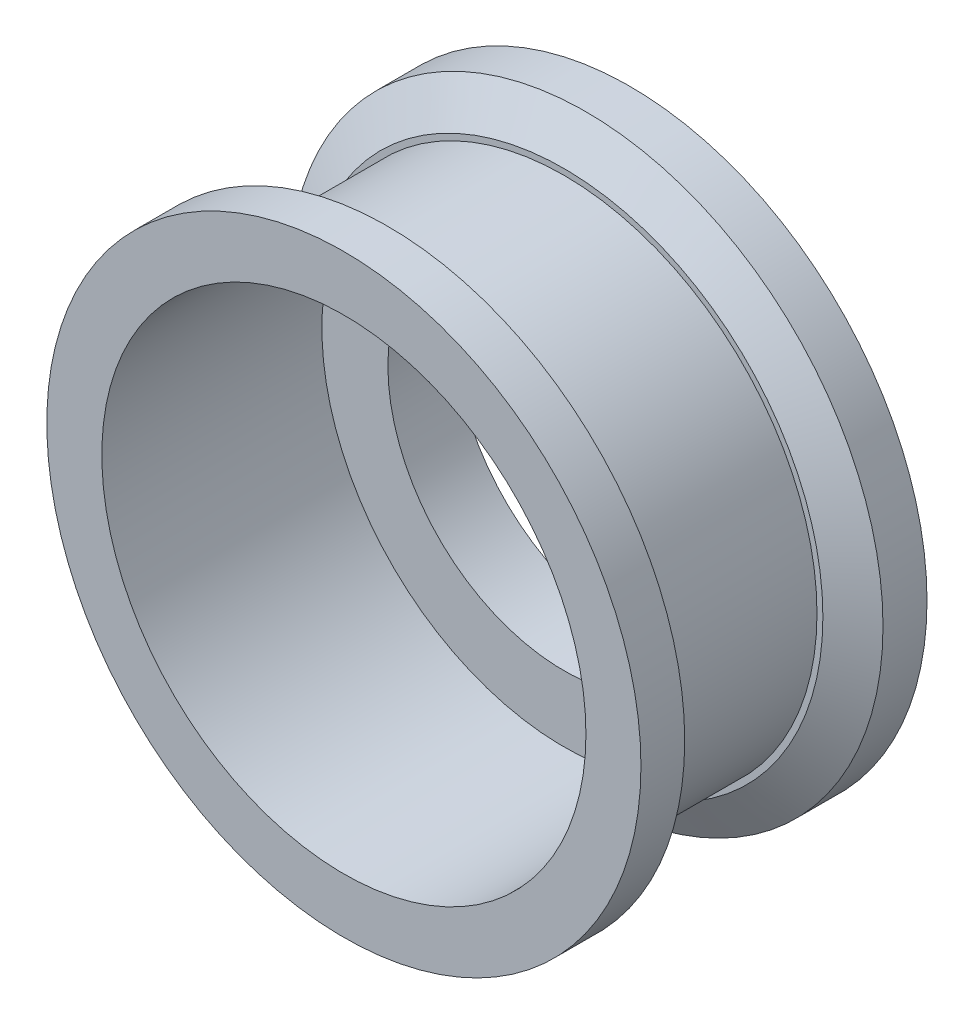
ISO-10303-21;
HEADER;
FILE_DESCRIPTION(('STEP AP214'),'2;1');
FILE_NAME('part.step','',(''),(''),'','','');
FILE_SCHEMA(('AUTOMOTIVE_DESIGN { 1 0 10303 214 1 1 1 1 }'));
ENDSEC;
DATA;
#1=APPLICATION_CONTEXT('core data for automotive mechanical design processes');
#2=APPLICATION_PROTOCOL_DEFINITION('international standard','automotive_design',2000,#1);
#3=PRODUCT_CONTEXT('',#1,'mechanical');
#4=PRODUCT('Part','Part','',(#3));
#5=PRODUCT_RELATED_PRODUCT_CATEGORY('part','',(#4));
#6=PRODUCT_DEFINITION_FORMATION('','',#4);
#7=PRODUCT_DEFINITION_CONTEXT('part definition',#1,'design');
#8=PRODUCT_DEFINITION('design','',#6,#7);
#9=PRODUCT_DEFINITION_SHAPE('','',#8);
#10=(LENGTH_UNIT() NAMED_UNIT(*) SI_UNIT(.MILLI.,.METRE.));
#11=(NAMED_UNIT(*) PLANE_ANGLE_UNIT() SI_UNIT($,.RADIAN.));
#12=(NAMED_UNIT(*) SI_UNIT($,.STERADIAN.) SOLID_ANGLE_UNIT());
#13=UNCERTAINTY_MEASURE_WITH_UNIT(LENGTH_MEASURE(1.E-05),#10,'distance_accuracy_value','');
#14=(GEOMETRIC_REPRESENTATION_CONTEXT(3) GLOBAL_UNCERTAINTY_ASSIGNED_CONTEXT((#13)) GLOBAL_UNIT_ASSIGNED_CONTEXT((#10,
#11,#12)) REPRESENTATION_CONTEXT('',''));
#15=CARTESIAN_POINT('',(0.,0.,0.));
#16=DIRECTION('',(0.,0.,1.));
#17=DIRECTION('',(1.,0.,0.));
#18=AXIS2_PLACEMENT_3D('',#15,#16,#17);
#19=CARTESIAN_POINT('',(0.,0.,13.));
#20=DIRECTION('',(0.,0.,-1.));
#21=DIRECTION('',(-1.,0.,0.));
#22=AXIS2_PLACEMENT_3D('',#19,#20,#21);
#23=CYLINDRICAL_SURFACE('',#22,13.5);
#24=CARTESIAN_POINT('',(0.,0.,2.00000000000001));
#25=DIRECTION('',(0.,0.,1.));
#26=DIRECTION('',(1.,0.,0.));
#27=AXIS2_PLACEMENT_3D('',#24,#25,#26);
#28=CIRCLE('',#27,13.5);
#29=CARTESIAN_POINT('',(13.5,0.,2.00000000000001));
#30=VERTEX_POINT('',#29);
#31=EDGE_CURVE('E11',#30,#30,#28,.F.);
#32=ORIENTED_EDGE('',*,*,#31,.T.);
#33=EDGE_LOOP('',(#32));
#34=FACE_BOUND('',#33,.T.);
#35=CARTESIAN_POINT('',(0.,0.,0.));
#36=DIRECTION('',(0.,0.,1.));
#37=DIRECTION('',(1.,0.,0.));
#38=AXIS2_PLACEMENT_3D('',#35,#36,#37);
#39=CIRCLE('',#38,13.5);
#40=CARTESIAN_POINT('',(13.5,0.,0.));
#41=VERTEX_POINT('',#40);
#42=EDGE_CURVE('E69',#41,#41,#39,.T.);
#43=ORIENTED_EDGE('',*,*,#42,.T.);
#44=EDGE_LOOP('',(#43));
#45=FACE_BOUND('',#44,.T.);
#46=ADVANCED_FACE('F38',(#34,#45),#23,.T.);
#47=CARTESIAN_POINT('',(0.,0.,13.));
#48=DIRECTION('',(0.,0.,-1.));
#49=DIRECTION('',(-1.,0.,0.));
#50=AXIS2_PLACEMENT_3D('',#47,#48,#49);
#51=CYLINDRICAL_SURFACE('',#50,8.);
#52=CARTESIAN_POINT('',(0.,0.,0.));
#53=DIRECTION('',(0.,0.,1.));
#54=DIRECTION('',(1.,0.,0.));
#55=AXIS2_PLACEMENT_3D('',#52,#53,#54);
#56=CIRCLE('',#55,8.);
#57=CARTESIAN_POINT('',(8.,0.,0.));
#58=VERTEX_POINT('',#57);
#59=EDGE_CURVE('E67',#58,#58,#56,.T.);
#60=ORIENTED_EDGE('',*,*,#59,.F.);
#61=EDGE_LOOP('',(#60));
#62=FACE_BOUND('',#61,.T.);
#63=CARTESIAN_POINT('',(0.,0.,3.));
#64=DIRECTION('',(0.,0.,1.));
#65=DIRECTION('',(1.,0.,0.));
#66=AXIS2_PLACEMENT_3D('',#63,#64,#65);
#67=CIRCLE('',#66,8.);
#68=CARTESIAN_POINT('',(8.,0.,3.));
#69=VERTEX_POINT('',#68);
#70=EDGE_CURVE('E63',#69,#69,#67,.T.);
#71=ORIENTED_EDGE('',*,*,#70,.T.);
#72=EDGE_LOOP('',(#71));
#73=FACE_BOUND('',#72,.T.);
#74=ADVANCED_FACE('F114',(#62,#73),#51,.F.);
#75=CARTESIAN_POINT('',(0.,0.,13.));
#76=DIRECTION('',(0.,0.,1.));
#77=DIRECTION('',(1.,0.,0.));
#78=AXIS2_PLACEMENT_3D('',#75,#76,#77);
#79=PLANE('',#78);
#80=CARTESIAN_POINT('',(0.,0.,13.));
#81=DIRECTION('',(0.,0.,1.));
#82=DIRECTION('',(1.,0.,0.));
#83=AXIS2_PLACEMENT_3D('',#80,#81,#82);
#84=CIRCLE('',#83,11.);
#85=CARTESIAN_POINT('',(11.,0.,13.));
#86=VERTEX_POINT('',#85);
#87=EDGE_CURVE('E79',#86,#86,#84,.T.);
#88=ORIENTED_EDGE('',*,*,#87,.F.);
#89=EDGE_LOOP('',(#88));
#90=FACE_BOUND('',#89,.T.);
#91=CARTESIAN_POINT('',(0.,0.,13.));
#92=DIRECTION('',(0.,0.,1.));
#93=DIRECTION('',(1.,0.,0.));
#94=AXIS2_PLACEMENT_3D('',#91,#92,#93);
#95=CIRCLE('',#94,13.5);
#96=CARTESIAN_POINT('',(13.5,0.,13.));
#97=VERTEX_POINT('',#96);
#98=EDGE_CURVE('E62',#97,#97,#95,.T.);
#99=ORIENTED_EDGE('',*,*,#98,.T.);
#100=EDGE_LOOP('',(#99));
#101=FACE_BOUND('',#100,.T.);
#102=ADVANCED_FACE('F120',(#90,#101),#79,.T.);
#103=CARTESIAN_POINT('',(0.,0.,0.));
#104=DIRECTION('',(0.,0.,1.));
#105=DIRECTION('',(1.,0.,0.));
#106=AXIS2_PLACEMENT_3D('',#103,#104,#105);
#107=PLANE('',#106);
#108=ORIENTED_EDGE('',*,*,#42,.F.);
#109=EDGE_LOOP('',(#108));
#110=FACE_BOUND('',#109,.T.);
#111=ORIENTED_EDGE('',*,*,#59,.T.);
#112=EDGE_LOOP('',(#111));
#113=FACE_BOUND('',#112,.T.);
#114=ADVANCED_FACE('F126',(#110,#113),#107,.F.);
#115=CARTESIAN_POINT('',(0.,0.,11.0103629710818));
#116=DIRECTION('',(0.,0.,1.));
#117=DIRECTION('',(1.,0.,0.));
#118=AXIS2_PLACEMENT_3D('',#115,#116,#117);
#119=CIRCLE('',#118,13.5);
#120=CARTESIAN_POINT('',(13.5,0.,11.0103629710818));
#121=VERTEX_POINT('',#120);
#122=EDGE_CURVE('E56',#121,#121,#119,.T.);
#123=ORIENTED_EDGE('',*,*,#122,.T.);
#124=EDGE_LOOP('',(#123));
#125=FACE_BOUND('',#124,.T.);
#126=ORIENTED_EDGE('',*,*,#98,.F.);
#127=EDGE_LOOP('',(#126));
#128=FACE_BOUND('',#127,.T.);
#129=ADVANCED_FACE('F116',(#125,#128),#23,.T.);
#130=CARTESIAN_POINT('',(0.,0.,3.));
#131=DIRECTION('',(0.,0.,1.));
#132=DIRECTION('',(1.,0.,0.));
#133=AXIS2_PLACEMENT_3D('',#130,#131,#132);
#134=CYLINDRICAL_SURFACE('',#133,11.);
#135=CARTESIAN_POINT('',(0.,0.,3.));
#136=DIRECTION('',(0.,0.,1.));
#137=DIRECTION('',(1.,0.,0.));
#138=AXIS2_PLACEMENT_3D('',#135,#136,#137);
#139=CIRCLE('',#138,11.);
#140=CARTESIAN_POINT('',(11.,0.,3.));
#141=VERTEX_POINT('',#140);
#142=EDGE_CURVE('E68',#141,#141,#139,.T.);
#143=ORIENTED_EDGE('',*,*,#142,.F.);
#144=EDGE_LOOP('',(#143));
#145=FACE_BOUND('',#144,.T.);
#146=ORIENTED_EDGE('',*,*,#87,.T.);
#147=EDGE_LOOP('',(#146));
#148=FACE_BOUND('',#147,.T.);
#149=ADVANCED_FACE('F109',(#145,#148),#134,.F.);
#150=CARTESIAN_POINT('',(0.,0.,3.));
#151=DIRECTION('',(0.,0.,1.));
#152=DIRECTION('',(1.,0.,0.));
#153=AXIS2_PLACEMENT_3D('',#150,#151,#152);
#154=PLANE('',#153);
#155=ORIENTED_EDGE('',*,*,#70,.F.);
#156=EDGE_LOOP('',(#155));
#157=FACE_BOUND('',#156,.T.);
#158=ORIENTED_EDGE('',*,*,#142,.T.);
#159=EDGE_LOOP('',(#158));
#160=FACE_BOUND('',#159,.T.);
#161=ADVANCED_FACE('F101',(#157,#160),#154,.T.);
#162=CARTESIAN_POINT('',(0.,0.,3.));
#163=DIRECTION('',(0.,0.,1.));
#164=DIRECTION('',(1.,0.,0.));
#165=AXIS2_PLACEMENT_3D('',#162,#163,#164);
#166=PLANE('',#165);
#167=CARTESIAN_POINT('',(0.,0.,3.));
#168=DIRECTION('',(0.,0.,1.));
#169=DIRECTION('',(1.,0.,0.));
#170=AXIS2_PLACEMENT_3D('',#167,#168,#169);
#171=CIRCLE('',#170,11.7679491924311);
#172=CARTESIAN_POINT('',(11.7679491924311,0.,3.));
#173=VERTEX_POINT('',#172);
#174=EDGE_CURVE('E46',#173,#173,#171,.T.);
#175=ORIENTED_EDGE('',*,*,#174,.T.);
#176=EDGE_LOOP('',(#175));
#177=FACE_BOUND('',#176,.T.);
#178=CARTESIAN_POINT('',(0.,0.,3.));
#179=DIRECTION('',(0.,0.,1.));
#180=DIRECTION('',(1.,0.,0.));
#181=AXIS2_PLACEMENT_3D('',#178,#179,#180);
#182=CIRCLE('',#181,11.5);
#183=CARTESIAN_POINT('',(11.5,0.,3.));
#184=VERTEX_POINT('',#183);
#185=EDGE_CURVE('E83',#184,#184,#182,.T.);
#186=ORIENTED_EDGE('',*,*,#185,.F.);
#187=EDGE_LOOP('',(#186));
#188=FACE_BOUND('',#187,.T.);
#189=ADVANCED_FACE('F98',(#177,#188),#166,.T.);
#190=CARTESIAN_POINT('',(0.,0.,10.));
#191=DIRECTION('',(0.,0.,1.));
#192=DIRECTION('',(1.,0.,0.));
#193=AXIS2_PLACEMENT_3D('',#190,#191,#192);
#194=PLANE('',#193);
#195=CARTESIAN_POINT('',(0.,0.,10.));
#196=DIRECTION('',(0.,0.,1.));
#197=DIRECTION('',(1.,0.,0.));
#198=AXIS2_PLACEMENT_3D('',#195,#196,#197);
#199=CIRCLE('',#198,11.75);
#200=CARTESIAN_POINT('',(11.75,0.,10.));
#201=VERTEX_POINT('',#200);
#202=EDGE_CURVE('E51',#201,#201,#199,.F.);
#203=ORIENTED_EDGE('',*,*,#202,.T.);
#204=EDGE_LOOP('',(#203));
#205=FACE_BOUND('',#204,.T.);
#206=CARTESIAN_POINT('',(0.,0.,10.));
#207=DIRECTION('',(0.,0.,1.));
#208=DIRECTION('',(1.,0.,0.));
#209=AXIS2_PLACEMENT_3D('',#206,#207,#208);
#210=CIRCLE('',#209,11.5);
#211=CARTESIAN_POINT('',(11.5,0.,10.));
#212=VERTEX_POINT('',#211);
#213=EDGE_CURVE('E87',#212,#212,#210,.T.);
#214=ORIENTED_EDGE('',*,*,#213,.T.);
#215=EDGE_LOOP('',(#214));
#216=FACE_BOUND('',#215,.T.);
#217=ADVANCED_FACE('F100',(#205,#216),#194,.F.);
#218=CARTESIAN_POINT('',(0.,0.,3.));
#219=DIRECTION('',(0.,0.,1.));
#220=DIRECTION('',(1.,0.,0.));
#221=AXIS2_PLACEMENT_3D('',#218,#219,#220);
#222=CYLINDRICAL_SURFACE('',#221,11.5);
#223=ORIENTED_EDGE('',*,*,#185,.T.);
#224=EDGE_LOOP('',(#223));
#225=FACE_BOUND('',#224,.T.);
#226=ORIENTED_EDGE('',*,*,#213,.F.);
#227=EDGE_LOOP('',(#226));
#228=FACE_BOUND('',#227,.T.);
#229=ADVANCED_FACE('F95',(#225,#228),#222,.T.);
#230=CARTESIAN_POINT('',(0.,0.,11.0103629710818));
#231=DIRECTION('',(0.,0.,1.));
#232=DIRECTION('',(1.,0.,0.));
#233=AXIS2_PLACEMENT_3D('',#230,#231,#232);
#234=CONICAL_SURFACE('',#233,13.5,1.0471975511966);
#235=ORIENTED_EDGE('',*,*,#202,.F.);
#236=EDGE_LOOP('',(#235));
#237=FACE_BOUND('',#236,.T.);
#238=ORIENTED_EDGE('',*,*,#122,.F.);
#239=EDGE_LOOP('',(#238));
#240=FACE_BOUND('',#239,.T.);
#241=ADVANCED_FACE('F194',(#237,#240),#234,.T.);
#242=CARTESIAN_POINT('',(0.,0.,3.));
#243=DIRECTION('',(0.,0.,-1.));
#244=DIRECTION('',(-1.,0.,0.));
#245=AXIS2_PLACEMENT_3D('',#242,#243,#244);
#246=CONICAL_SURFACE('',#245,11.7679491924311,1.0471975511966);
#247=ORIENTED_EDGE('',*,*,#31,.F.);
#248=EDGE_LOOP('',(#247));
#249=FACE_BOUND('',#248,.T.);
#250=ORIENTED_EDGE('',*,*,#174,.F.);
#251=EDGE_LOOP('',(#250));
#252=FACE_BOUND('',#251,.T.);
#253=ADVANCED_FACE('F40',(#249,#252),#246,.T.);
#254=CLOSED_SHELL('',(#46,#74,#102,#114,#129,#149,#161,#189,#217,#229,#241,#253));
#255=MANIFOLD_SOLID_BREP('B2',#254);
#256=ADVANCED_BREP_SHAPE_REPRESENTATION('',(#18,#255),#14);
#257=SHAPE_DEFINITION_REPRESENTATION(#9,#256);
ENDSEC;
END-ISO-10303-21;
